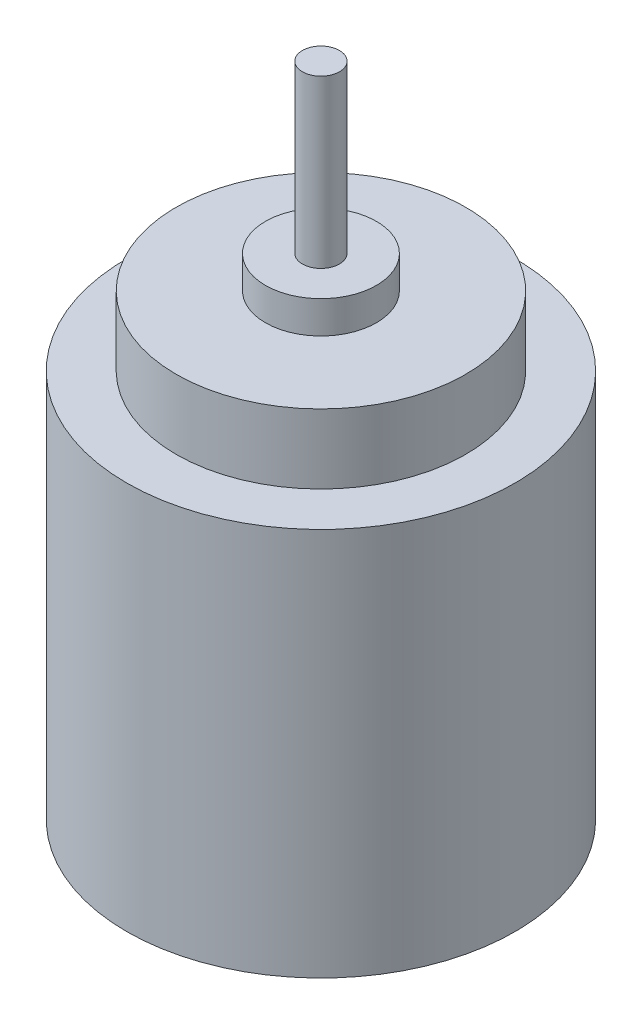
ISO-10303-21;
HEADER;
FILE_DESCRIPTION(('STEP AP214'),'2;1');
FILE_NAME('part.step','',(''),(''),'','','');
FILE_SCHEMA(('AUTOMOTIVE_DESIGN { 1 0 10303 214 1 1 1 1 }'));
ENDSEC;
DATA;
#1=APPLICATION_CONTEXT('core data for automotive mechanical design processes');
#2=APPLICATION_PROTOCOL_DEFINITION('international standard','automotive_design',2000,#1);
#3=PRODUCT_CONTEXT('',#1,'mechanical');
#4=PRODUCT('Part','Part','',(#3));
#5=PRODUCT_RELATED_PRODUCT_CATEGORY('part','',(#4));
#6=PRODUCT_DEFINITION_FORMATION('','',#4);
#7=PRODUCT_DEFINITION_CONTEXT('part definition',#1,'design');
#8=PRODUCT_DEFINITION('design','',#6,#7);
#9=PRODUCT_DEFINITION_SHAPE('','',#8);
#10=(LENGTH_UNIT() NAMED_UNIT(*) SI_UNIT(.MILLI.,.METRE.));
#11=(NAMED_UNIT(*) PLANE_ANGLE_UNIT() SI_UNIT($,.RADIAN.));
#12=(NAMED_UNIT(*) SI_UNIT($,.STERADIAN.) SOLID_ANGLE_UNIT());
#13=UNCERTAINTY_MEASURE_WITH_UNIT(LENGTH_MEASURE(1.E-05),#10,'distance_accuracy_value','');
#14=(GEOMETRIC_REPRESENTATION_CONTEXT(3) GLOBAL_UNCERTAINTY_ASSIGNED_CONTEXT((#13)) GLOBAL_UNIT_ASSIGNED_CONTEXT((#10,
#11,#12)) REPRESENTATION_CONTEXT('',''));
#15=CARTESIAN_POINT('',(0.,0.,0.));
#16=DIRECTION('',(0.,0.,1.));
#17=DIRECTION('',(1.,0.,0.));
#18=AXIS2_PLACEMENT_3D('',#15,#16,#17);
#19=CARTESIAN_POINT('',(0.,21.,0.));
#20=DIRECTION('',(0.,-1.,0.));
#21=DIRECTION('',(0.,0.,-1.));
#22=AXIS2_PLACEMENT_3D('',#19,#20,#21);
#23=CYLINDRICAL_SURFACE('',#22,10.5);
#24=CARTESIAN_POINT('',(0.,21.,0.));
#25=DIRECTION('',(0.,1.,0.));
#26=DIRECTION('',(0.,0.,1.));
#27=AXIS2_PLACEMENT_3D('',#24,#25,#26);
#28=CIRCLE('',#27,10.5);
#29=CARTESIAN_POINT('',(0.,21.,10.5));
#30=VERTEX_POINT('',#29);
#31=EDGE_CURVE('E66',#30,#30,#28,.T.);
#32=ORIENTED_EDGE('',*,*,#31,.F.);
#33=EDGE_LOOP('',(#32));
#34=FACE_BOUND('',#33,.T.);
#35=CARTESIAN_POINT('',(0.,0.,0.));
#36=DIRECTION('',(0.,1.,0.));
#37=DIRECTION('',(0.,0.,1.));
#38=AXIS2_PLACEMENT_3D('',#35,#36,#37);
#39=CIRCLE('',#38,10.5);
#40=CARTESIAN_POINT('',(0.,0.,10.5));
#41=VERTEX_POINT('',#40);
#42=EDGE_CURVE('E40',#41,#41,#39,.T.);
#43=ORIENTED_EDGE('',*,*,#42,.T.);
#44=EDGE_LOOP('',(#43));
#45=FACE_BOUND('',#44,.T.);
#46=ADVANCED_FACE('F37',(#34,#45),#23,.T.);
#47=CARTESIAN_POINT('',(0.,21.,0.));
#48=DIRECTION('',(0.,1.,0.));
#49=DIRECTION('',(0.,0.,1.));
#50=AXIS2_PLACEMENT_3D('',#47,#48,#49);
#51=PLANE('',#50);
#52=CARTESIAN_POINT('',(0.,21.,0.));
#53=DIRECTION('',(0.,1.,0.));
#54=DIRECTION('',(0.,0.,1.));
#55=AXIS2_PLACEMENT_3D('',#52,#53,#54);
#56=CIRCLE('',#55,7.825);
#57=CARTESIAN_POINT('',(0.,21.,7.825));
#58=VERTEX_POINT('',#57);
#59=EDGE_CURVE('E51',#58,#58,#56,.T.);
#60=ORIENTED_EDGE('',*,*,#59,.F.);
#61=EDGE_LOOP('',(#60));
#62=FACE_BOUND('',#61,.T.);
#63=ORIENTED_EDGE('',*,*,#31,.T.);
#64=EDGE_LOOP('',(#63));
#65=FACE_BOUND('',#64,.T.);
#66=ADVANCED_FACE('F79',(#62,#65),#51,.T.);
#67=CARTESIAN_POINT('',(0.,0.,0.));
#68=DIRECTION('',(0.,1.,0.));
#69=DIRECTION('',(0.,0.,1.));
#70=AXIS2_PLACEMENT_3D('',#67,#68,#69);
#71=PLANE('',#70);
#72=ORIENTED_EDGE('',*,*,#42,.F.);
#73=EDGE_LOOP('',(#72));
#74=FACE_BOUND('',#73,.T.);
#75=ADVANCED_FACE('F76',(#74),#71,.F.);
#76=CARTESIAN_POINT('',(0.,24.75,0.));
#77=DIRECTION('',(0.,-1.,0.));
#78=DIRECTION('',(0.,0.,-1.));
#79=AXIS2_PLACEMENT_3D('',#76,#77,#78);
#80=CYLINDRICAL_SURFACE('',#79,7.825);
#81=CARTESIAN_POINT('',(0.,24.75,0.));
#82=DIRECTION('',(0.,1.,0.));
#83=DIRECTION('',(0.,0.,1.));
#84=AXIS2_PLACEMENT_3D('',#81,#82,#83);
#85=CIRCLE('',#84,7.825);
#86=CARTESIAN_POINT('',(0.,24.75,7.825));
#87=VERTEX_POINT('',#86);
#88=EDGE_CURVE('E59',#87,#87,#85,.T.);
#89=ORIENTED_EDGE('',*,*,#88,.F.);
#90=EDGE_LOOP('',(#89));
#91=FACE_BOUND('',#90,.T.);
#92=ORIENTED_EDGE('',*,*,#59,.T.);
#93=EDGE_LOOP('',(#92));
#94=FACE_BOUND('',#93,.T.);
#95=ADVANCED_FACE('F78',(#91,#94),#80,.T.);
#96=CARTESIAN_POINT('',(0.,24.75,0.));
#97=DIRECTION('',(0.,1.,0.));
#98=DIRECTION('',(0.,0.,1.));
#99=AXIS2_PLACEMENT_3D('',#96,#97,#98);
#100=PLANE('',#99);
#101=CARTESIAN_POINT('',(0.,24.75,0.));
#102=DIRECTION('',(0.,1.,0.));
#103=DIRECTION('',(0.,0.,1.));
#104=AXIS2_PLACEMENT_3D('',#101,#102,#103);
#105=CIRCLE('',#104,3.);
#106=CARTESIAN_POINT('',(0.,24.75,3.));
#107=VERTEX_POINT('',#106);
#108=EDGE_CURVE('E45',#107,#107,#105,.T.);
#109=ORIENTED_EDGE('',*,*,#108,.F.);
#110=EDGE_LOOP('',(#109));
#111=FACE_BOUND('',#110,.T.);
#112=ORIENTED_EDGE('',*,*,#88,.T.);
#113=EDGE_LOOP('',(#112));
#114=FACE_BOUND('',#113,.T.);
#115=ADVANCED_FACE('F84',(#111,#114),#100,.T.);
#116=CARTESIAN_POINT('',(0.,26.5,0.));
#117=DIRECTION('',(0.,-1.,0.));
#118=DIRECTION('',(0.,0.,-1.));
#119=AXIS2_PLACEMENT_3D('',#116,#117,#118);
#120=CYLINDRICAL_SURFACE('',#119,3.);
#121=CARTESIAN_POINT('',(0.,26.5,0.));
#122=DIRECTION('',(0.,1.,0.));
#123=DIRECTION('',(0.,0.,1.));
#124=AXIS2_PLACEMENT_3D('',#121,#122,#123);
#125=CIRCLE('',#124,3.);
#126=CARTESIAN_POINT('',(0.,26.5,3.));
#127=VERTEX_POINT('',#126);
#128=EDGE_CURVE('E56',#127,#127,#125,.T.);
#129=ORIENTED_EDGE('',*,*,#128,.F.);
#130=EDGE_LOOP('',(#129));
#131=FACE_BOUND('',#130,.T.);
#132=ORIENTED_EDGE('',*,*,#108,.T.);
#133=EDGE_LOOP('',(#132));
#134=FACE_BOUND('',#133,.T.);
#135=ADVANCED_FACE('F114',(#131,#134),#120,.T.);
#136=CARTESIAN_POINT('',(0.,26.5,0.));
#137=DIRECTION('',(0.,1.,0.));
#138=DIRECTION('',(0.,0.,1.));
#139=AXIS2_PLACEMENT_3D('',#136,#137,#138);
#140=PLANE('',#139);
#141=CARTESIAN_POINT('',(0.,26.5,0.));
#142=DIRECTION('',(0.,1.,0.));
#143=DIRECTION('',(0.,0.,1.));
#144=AXIS2_PLACEMENT_3D('',#141,#142,#143);
#145=CIRCLE('',#144,1.);
#146=CARTESIAN_POINT('',(0.,26.5,1.));
#147=VERTEX_POINT('',#146);
#148=EDGE_CURVE('E10',#147,#147,#145,.T.);
#149=ORIENTED_EDGE('',*,*,#148,.F.);
#150=EDGE_LOOP('',(#149));
#151=FACE_BOUND('',#150,.T.);
#152=ORIENTED_EDGE('',*,*,#128,.T.);
#153=EDGE_LOOP('',(#152));
#154=FACE_BOUND('',#153,.T.);
#155=ADVANCED_FACE('F124',(#151,#154),#140,.T.);
#156=CARTESIAN_POINT('',(0.,35.5,0.));
#157=DIRECTION('',(0.,-1.,0.));
#158=DIRECTION('',(0.,0.,-1.));
#159=AXIS2_PLACEMENT_3D('',#156,#157,#158);
#160=CYLINDRICAL_SURFACE('',#159,1.);
#161=CARTESIAN_POINT('',(0.,35.5,0.));
#162=DIRECTION('',(0.,1.,0.));
#163=DIRECTION('',(0.,0.,1.));
#164=AXIS2_PLACEMENT_3D('',#161,#162,#163);
#165=CIRCLE('',#164,1.);
#166=CARTESIAN_POINT('',(0.,35.5,1.));
#167=VERTEX_POINT('',#166);
#168=EDGE_CURVE('E55',#167,#167,#165,.T.);
#169=ORIENTED_EDGE('',*,*,#168,.F.);
#170=EDGE_LOOP('',(#169));
#171=FACE_BOUND('',#170,.T.);
#172=ORIENTED_EDGE('',*,*,#148,.T.);
#173=EDGE_LOOP('',(#172));
#174=FACE_BOUND('',#173,.T.);
#175=ADVANCED_FACE('F134',(#171,#174),#160,.T.);
#176=CARTESIAN_POINT('',(0.,35.5,0.));
#177=DIRECTION('',(0.,1.,0.));
#178=DIRECTION('',(0.,0.,1.));
#179=AXIS2_PLACEMENT_3D('',#176,#177,#178);
#180=PLANE('',#179);
#181=ORIENTED_EDGE('',*,*,#168,.T.);
#182=EDGE_LOOP('',(#181));
#183=FACE_BOUND('',#182,.T.);
#184=ADVANCED_FACE('F144',(#183),#180,.T.);
#185=CLOSED_SHELL('',(#46,#66,#75,#95,#115,#135,#155,#175,#184));
#186=MANIFOLD_SOLID_BREP('B2',#185);
#187=ADVANCED_BREP_SHAPE_REPRESENTATION('',(#18,#186),#14);
#188=SHAPE_DEFINITION_REPRESENTATION(#9,#187);
ENDSEC;
END-ISO-10303-21;
